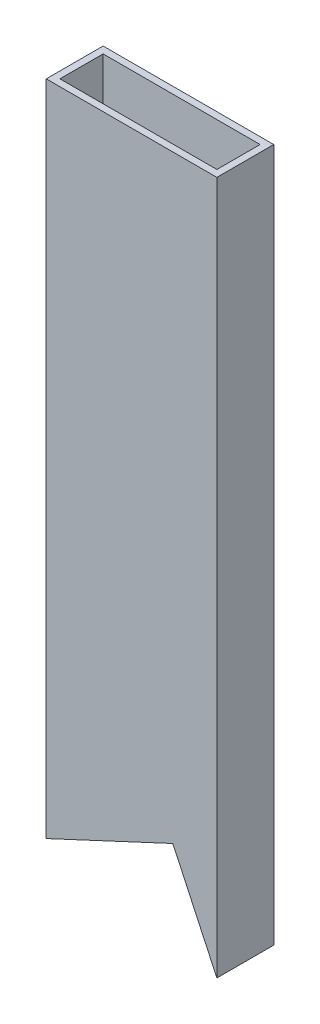
ISO-10303-21;
HEADER;
FILE_DESCRIPTION(('STEP AP214'),'2;1');
FILE_NAME('part.step','',(''),(''),'','','');
FILE_SCHEMA(('AUTOMOTIVE_DESIGN { 1 0 10303 214 1 1 1 1 }'));
ENDSEC;
DATA;
#1=APPLICATION_CONTEXT('core data for automotive mechanical design processes');
#2=APPLICATION_PROTOCOL_DEFINITION('international standard','automotive_design',2000,#1);
#3=PRODUCT_CONTEXT('',#1,'mechanical');
#4=PRODUCT('Part','Part','',(#3));
#5=PRODUCT_RELATED_PRODUCT_CATEGORY('part','',(#4));
#6=PRODUCT_DEFINITION_FORMATION('','',#4);
#7=PRODUCT_DEFINITION_CONTEXT('part definition',#1,'design');
#8=PRODUCT_DEFINITION('design','',#6,#7);
#9=PRODUCT_DEFINITION_SHAPE('','',#8);
#10=(LENGTH_UNIT() NAMED_UNIT(*) SI_UNIT(.MILLI.,.METRE.));
#11=(NAMED_UNIT(*) PLANE_ANGLE_UNIT() SI_UNIT($,.RADIAN.));
#12=(NAMED_UNIT(*) SI_UNIT($,.STERADIAN.) SOLID_ANGLE_UNIT());
#13=UNCERTAINTY_MEASURE_WITH_UNIT(LENGTH_MEASURE(1.E-05),#10,'distance_accuracy_value','');
#14=(GEOMETRIC_REPRESENTATION_CONTEXT(3) GLOBAL_UNCERTAINTY_ASSIGNED_CONTEXT((#13)) GLOBAL_UNIT_ASSIGNED_CONTEXT((#10,
#11,#12)) REPRESENTATION_CONTEXT('',''));
#15=CARTESIAN_POINT('',(0.,0.,0.));
#16=DIRECTION('',(0.,0.,1.));
#17=DIRECTION('',(1.,0.,0.));
#18=AXIS2_PLACEMENT_3D('',#15,#16,#17);
#19=CARTESIAN_POINT('',(-38.1,280.,-12.7));
#20=DIRECTION('',(1.,0.,0.));
#21=DIRECTION('',(0.,0.,-1.));
#22=AXIS2_PLACEMENT_3D('',#19,#20,#21);
#23=PLANE('',#22);
#24=DIRECTION('',(0.,0.,-1.));
#25=VECTOR('',#24,1.);
#26=CARTESIAN_POINT('',(-38.1,24.2723769367656,-12.7));
#27=LINE('',#26,#25);
#28=CARTESIAN_POINT('',(-38.1,24.2723769367656,12.7));
#29=VERTEX_POINT('',#28);
#30=CARTESIAN_POINT('',(-38.1,24.2723769367656,-12.7));
#31=VERTEX_POINT('',#30);
#32=EDGE_CURVE('E122',#29,#31,#27,.T.);
#33=ORIENTED_EDGE('',*,*,#32,.F.);
#34=DIRECTION('',(0.,-1.,0.));
#35=VECTOR('',#34,1.);
#36=CARTESIAN_POINT('',(-38.1,280.,12.7));
#37=LINE('',#36,#35);
#38=CARTESIAN_POINT('',(-38.1,318.1,12.7));
#39=VERTEX_POINT('',#38);
#40=EDGE_CURVE('E191',#39,#29,#37,.T.);
#41=ORIENTED_EDGE('',*,*,#40,.F.);
#42=DIRECTION('',(0.,0.,1.));
#43=VECTOR('',#42,1.);
#44=CARTESIAN_POINT('',(-38.1,318.1,-12.7));
#45=LINE('',#44,#43);
#46=CARTESIAN_POINT('',(-38.1,318.1,-12.7));
#47=VERTEX_POINT('',#46);
#48=EDGE_CURVE('E143',#47,#39,#45,.T.);
#49=ORIENTED_EDGE('',*,*,#48,.F.);
#50=DIRECTION('',(0.,-1.,0.));
#51=VECTOR('',#50,1.);
#52=CARTESIAN_POINT('',(-38.1,280.,-12.7));
#53=LINE('',#52,#51);
#54=EDGE_CURVE('E182',#47,#31,#53,.T.);
#55=ORIENTED_EDGE('',*,*,#54,.T.);
#56=EDGE_LOOP('',(#33,#41,#49,#55));
#57=FACE_BOUND('',#56,.T.);
#58=ADVANCED_FACE('F36',(#57),#23,.F.);
#59=CARTESIAN_POINT('',(-38.1,280.,12.7));
#60=DIRECTION('',(0.,0.,-1.));
#61=DIRECTION('',(-1.,0.,0.));
#62=AXIS2_PLACEMENT_3D('',#59,#60,#61);
#63=PLANE('',#62);
#64=DIRECTION('',(-0.906307787036651,-0.422618261740697,0.));
#65=VECTOR('',#64,1.);
#66=CARTESIAN_POINT('',(18.4285709137758,50.632082458417,12.7));
#67=LINE('',#66,#65);
#68=CARTESIAN_POINT('',(18.4285709137758,50.632082458417,12.7));
#69=VERTEX_POINT('',#68);
#70=EDGE_CURVE('E160',#69,#29,#67,.T.);
#71=ORIENTED_EDGE('',*,*,#70,.F.);
#72=DIRECTION('',(0.422618261740697,-0.906307787036651,0.));
#73=VECTOR('',#72,1.);
#74=CARTESIAN_POINT('',(18.4285709137758,50.632082458417,12.7));
#75=LINE('',#74,#73);
#76=CARTESIAN_POINT('',(38.1,8.44656664669595,12.7));
#77=VERTEX_POINT('',#76);
#78=EDGE_CURVE('E152',#69,#77,#75,.T.);
#79=ORIENTED_EDGE('',*,*,#78,.T.);
#80=DIRECTION('',(0.,-1.,0.));
#81=VECTOR('',#80,1.);
#82=CARTESIAN_POINT('',(38.1,280.,12.7));
#83=LINE('',#82,#81);
#84=CARTESIAN_POINT('',(38.1,318.1,12.7));
#85=VERTEX_POINT('',#84);
#86=EDGE_CURVE('E188',#85,#77,#83,.T.);
#87=ORIENTED_EDGE('',*,*,#86,.F.);
#88=DIRECTION('',(1.,0.,0.));
#89=VECTOR('',#88,1.);
#90=CARTESIAN_POINT('',(-38.1,318.1,12.7));
#91=LINE('',#90,#89);
#92=EDGE_CURVE('E146',#39,#85,#91,.T.);
#93=ORIENTED_EDGE('',*,*,#92,.F.);
#94=ORIENTED_EDGE('',*,*,#40,.T.);
#95=EDGE_LOOP('',(#71,#79,#87,#93,#94));
#96=FACE_BOUND('',#95,.T.);
#97=ADVANCED_FACE('F207',(#96),#63,.F.);
#98=CARTESIAN_POINT('',(-38.1,280.,-12.7));
#99=DIRECTION('',(0.,0.,1.));
#100=DIRECTION('',(1.,0.,0.));
#101=AXIS2_PLACEMENT_3D('',#98,#99,#100);
#102=PLANE('',#101);
#103=DIRECTION('',(-0.906307787036651,-0.422618261740697,0.));
#104=VECTOR('',#103,1.);
#105=CARTESIAN_POINT('',(18.4285709137758,50.632082458417,-12.7));
#106=LINE('',#105,#104);
#107=CARTESIAN_POINT('',(18.4285709137758,50.632082458417,-12.7));
#108=VERTEX_POINT('',#107);
#109=EDGE_CURVE('E162',#108,#31,#106,.T.);
#110=ORIENTED_EDGE('',*,*,#109,.T.);
#111=ORIENTED_EDGE('',*,*,#54,.F.);
#112=DIRECTION('',(-1.,0.,0.));
#113=VECTOR('',#112,1.);
#114=CARTESIAN_POINT('',(38.1,318.1,-12.7));
#115=LINE('',#114,#113);
#116=CARTESIAN_POINT('',(38.1,318.1,-12.7));
#117=VERTEX_POINT('',#116);
#118=EDGE_CURVE('E140',#117,#47,#115,.T.);
#119=ORIENTED_EDGE('',*,*,#118,.F.);
#120=DIRECTION('',(0.,-1.,0.));
#121=VECTOR('',#120,1.);
#122=CARTESIAN_POINT('',(38.1,280.,-12.7));
#123=LINE('',#122,#121);
#124=CARTESIAN_POINT('',(38.1,8.44656664669595,-12.7));
#125=VERTEX_POINT('',#124);
#126=EDGE_CURVE('E185',#117,#125,#123,.T.);
#127=ORIENTED_EDGE('',*,*,#126,.T.);
#128=DIRECTION('',(-0.422618261740697,0.906307787036651,0.));
#129=VECTOR('',#128,1.);
#130=CARTESIAN_POINT('',(18.4285709137758,50.632082458417,-12.7));
#131=LINE('',#130,#129);
#132=EDGE_CURVE('E155',#125,#108,#131,.T.);
#133=ORIENTED_EDGE('',*,*,#132,.T.);
#134=EDGE_LOOP('',(#110,#111,#119,#127,#133));
#135=FACE_BOUND('',#134,.T.);
#136=ADVANCED_FACE('F199',(#135),#102,.F.);
#137=CARTESIAN_POINT('',(-35.052,280.,-9.65199999999999));
#138=DIRECTION('',(1.,0.,0.));
#139=DIRECTION('',(0.,0.,-1.));
#140=AXIS2_PLACEMENT_3D('',#137,#138,#139);
#141=PLANE('',#140);
#142=DIRECTION('',(0.,-1.,0.));
#143=VECTOR('',#142,1.);
#144=CARTESIAN_POINT('',(-35.052,280.,9.652));
#145=LINE('',#144,#143);
#146=CARTESIAN_POINT('',(-35.052,318.1,9.652));
#147=VERTEX_POINT('',#146);
#148=CARTESIAN_POINT('',(-35.052,25.693682678822,9.652));
#149=VERTEX_POINT('',#148);
#150=EDGE_CURVE('E180',#147,#149,#145,.T.);
#151=ORIENTED_EDGE('',*,*,#150,.T.);
#152=DIRECTION('',(0.,0.,-1.));
#153=VECTOR('',#152,1.);
#154=CARTESIAN_POINT('',(-35.052,25.693682678822,-9.65199999999999));
#155=LINE('',#154,#153);
#156=CARTESIAN_POINT('',(-35.052,25.693682678822,-9.65199999999999));
#157=VERTEX_POINT('',#156);
#158=EDGE_CURVE('E119',#149,#157,#155,.T.);
#159=ORIENTED_EDGE('',*,*,#158,.T.);
#160=DIRECTION('',(0.,-1.,0.));
#161=VECTOR('',#160,1.);
#162=CARTESIAN_POINT('',(-35.052,280.,-9.65199999999999));
#163=LINE('',#162,#161);
#164=CARTESIAN_POINT('',(-35.052,318.1,-9.65199999999999));
#165=VERTEX_POINT('',#164);
#166=EDGE_CURVE('E112',#165,#157,#163,.T.);
#167=ORIENTED_EDGE('',*,*,#166,.F.);
#168=DIRECTION('',(0.,0.,1.));
#169=VECTOR('',#168,1.);
#170=CARTESIAN_POINT('',(-35.052,318.1,-9.65199999999999));
#171=LINE('',#170,#169);
#172=EDGE_CURVE('E117',#165,#147,#171,.T.);
#173=ORIENTED_EDGE('',*,*,#172,.T.);
#174=EDGE_LOOP('',(#151,#159,#167,#173));
#175=FACE_BOUND('',#174,.T.);
#176=ADVANCED_FACE('F115',(#175),#141,.T.);
#177=CARTESIAN_POINT('',(-35.052,280.,9.652));
#178=DIRECTION('',(0.,0.,-1.));
#179=DIRECTION('',(-1.,0.,0.));
#180=AXIS2_PLACEMENT_3D('',#177,#178,#179);
#181=PLANE('',#180);
#182=DIRECTION('',(0.422618261740697,-0.906307787036651,0.));
#183=VECTOR('',#182,1.);
#184=CARTESIAN_POINT('',(-78.9763997031937,259.51771603854,9.652));
#185=LINE('',#184,#183);
#186=CARTESIAN_POINT('',(18.4285709137758,50.632082458417,9.65199999999999));
#187=VERTEX_POINT('',#186);
#188=CARTESIAN_POINT('',(35.052,14.9830237404092,9.65199999999999));
#189=VERTEX_POINT('',#188);
#190=EDGE_CURVE('E166',#187,#189,#185,.T.);
#191=ORIENTED_EDGE('',*,*,#190,.F.);
#192=DIRECTION('',(-0.906307787036651,-0.422618261740697,0.));
#193=VECTOR('',#192,1.);
#194=CARTESIAN_POINT('',(62.3529706169696,71.1143664198772,9.65199999999999));
#195=LINE('',#194,#193);
#196=EDGE_CURVE('E172',#187,#149,#195,.T.);
#197=ORIENTED_EDGE('',*,*,#196,.T.);
#198=ORIENTED_EDGE('',*,*,#150,.F.);
#199=DIRECTION('',(1.,0.,0.));
#200=VECTOR('',#199,1.);
#201=CARTESIAN_POINT('',(-35.052,318.1,9.652));
#202=LINE('',#201,#200);
#203=CARTESIAN_POINT('',(35.052,318.1,9.65199999999999));
#204=VERTEX_POINT('',#203);
#205=EDGE_CURVE('E134',#147,#204,#202,.T.);
#206=ORIENTED_EDGE('',*,*,#205,.T.);
#207=DIRECTION('',(0.,-1.,0.));
#208=VECTOR('',#207,1.);
#209=CARTESIAN_POINT('',(35.052,280.,9.65199999999999));
#210=LINE('',#209,#208);
#211=EDGE_CURVE('E177',#204,#189,#210,.T.);
#212=ORIENTED_EDGE('',*,*,#211,.T.);
#213=EDGE_LOOP('',(#191,#197,#198,#206,#212));
#214=FACE_BOUND('',#213,.T.);
#215=ADVANCED_FACE('F214',(#214),#181,.T.);
#216=CARTESIAN_POINT('',(-35.052,280.,-9.65199999999999));
#217=DIRECTION('',(0.,0.,1.));
#218=DIRECTION('',(1.,0.,0.));
#219=AXIS2_PLACEMENT_3D('',#216,#217,#218);
#220=PLANE('',#219);
#221=ORIENTED_EDGE('',*,*,#166,.T.);
#222=DIRECTION('',(0.906307787036651,0.422618261740697,0.));
#223=VECTOR('',#222,1.);
#224=CARTESIAN_POINT('',(62.3529706169696,71.1143664198772,-9.652));
#225=LINE('',#224,#223);
#226=CARTESIAN_POINT('',(18.4285709137758,50.632082458417,-9.65199999999999));
#227=VERTEX_POINT('',#226);
#228=EDGE_CURVE('E11',#157,#227,#225,.T.);
#229=ORIENTED_EDGE('',*,*,#228,.T.);
#230=DIRECTION('',(-0.422618261740697,0.906307787036651,0.));
#231=VECTOR('',#230,1.);
#232=CARTESIAN_POINT('',(-78.9763997031937,259.51771603854,-9.65199999999998));
#233=LINE('',#232,#231);
#234=CARTESIAN_POINT('',(35.052,14.9830237404091,-9.652));
#235=VERTEX_POINT('',#234);
#236=EDGE_CURVE('E43',#235,#227,#233,.T.);
#237=ORIENTED_EDGE('',*,*,#236,.F.);
#238=DIRECTION('',(0.,-1.,0.));
#239=VECTOR('',#238,1.);
#240=CARTESIAN_POINT('',(35.052,280.,-9.652));
#241=LINE('',#240,#239);
#242=CARTESIAN_POINT('',(35.052,318.1,-9.652));
#243=VERTEX_POINT('',#242);
#244=EDGE_CURVE('E121',#243,#235,#241,.T.);
#245=ORIENTED_EDGE('',*,*,#244,.F.);
#246=DIRECTION('',(-1.,0.,0.));
#247=VECTOR('',#246,1.);
#248=CARTESIAN_POINT('',(35.052,318.1,-9.652));
#249=LINE('',#248,#247);
#250=EDGE_CURVE('E125',#243,#165,#249,.T.);
#251=ORIENTED_EDGE('',*,*,#250,.T.);
#252=EDGE_LOOP('',(#221,#229,#237,#245,#251));
#253=FACE_BOUND('',#252,.T.);
#254=ADVANCED_FACE('F126',(#253),#220,.T.);
#255=CARTESIAN_POINT('',(38.1,280.,-12.7));
#256=DIRECTION('',(-1.,0.,0.));
#257=DIRECTION('',(0.,0.,1.));
#258=AXIS2_PLACEMENT_3D('',#255,#256,#257);
#259=PLANE('',#258);
#260=ORIENTED_EDGE('',*,*,#86,.T.);
#261=DIRECTION('',(0.,0.,-1.));
#262=VECTOR('',#261,1.);
#263=CARTESIAN_POINT('',(38.1,8.44656664669596,-12.6999999999998));
#264=LINE('',#263,#262);
#265=EDGE_CURVE('E168',#77,#125,#264,.T.);
#266=ORIENTED_EDGE('',*,*,#265,.T.);
#267=ORIENTED_EDGE('',*,*,#126,.F.);
#268=DIRECTION('',(0.,0.,-1.));
#269=VECTOR('',#268,1.);
#270=CARTESIAN_POINT('',(38.1,318.1,12.7));
#271=LINE('',#270,#269);
#272=EDGE_CURVE('E149',#85,#117,#271,.T.);
#273=ORIENTED_EDGE('',*,*,#272,.F.);
#274=EDGE_LOOP('',(#260,#266,#267,#273));
#275=FACE_BOUND('',#274,.T.);
#276=ADVANCED_FACE('F202',(#275),#259,.F.);
#277=CARTESIAN_POINT('',(35.052,280.,-9.652));
#278=DIRECTION('',(-1.,0.,0.));
#279=DIRECTION('',(0.,0.,1.));
#280=AXIS2_PLACEMENT_3D('',#277,#278,#279);
#281=PLANE('',#280);
#282=DIRECTION('',(0.,0.,-1.));
#283=VECTOR('',#282,1.);
#284=CARTESIAN_POINT('',(35.052,14.9830237404092,-9.652));
#285=LINE('',#284,#283);
#286=EDGE_CURVE('E56',#189,#235,#285,.T.);
#287=ORIENTED_EDGE('',*,*,#286,.F.);
#288=ORIENTED_EDGE('',*,*,#211,.F.);
#289=DIRECTION('',(0.,0.,-1.));
#290=VECTOR('',#289,1.);
#291=CARTESIAN_POINT('',(35.052,318.1,9.65199999999999));
#292=LINE('',#291,#290);
#293=EDGE_CURVE('E136',#204,#243,#292,.T.);
#294=ORIENTED_EDGE('',*,*,#293,.T.);
#295=ORIENTED_EDGE('',*,*,#244,.T.);
#296=EDGE_LOOP('',(#287,#288,#294,#295));
#297=FACE_BOUND('',#296,.T.);
#298=ADVANCED_FACE('F216',(#297),#281,.T.);
#299=CARTESIAN_POINT('',(18.4285709137758,50.632082458417,12.7));
#300=DIRECTION('',(0.422618261740697,-0.906307787036651,0.));
#301=DIRECTION('',(0.906307787036651,0.422618261740697,0.));
#302=AXIS2_PLACEMENT_3D('',#299,#300,#301);
#303=PLANE('',#302);
#304=ORIENTED_EDGE('',*,*,#32,.T.);
#305=ORIENTED_EDGE('',*,*,#109,.F.);
#306=DIRECTION('',(0.,0.,1.));
#307=VECTOR('',#306,1.);
#308=CARTESIAN_POINT('',(18.4285709137758,50.632082458417,12.7));
#309=LINE('',#308,#307);
#310=EDGE_CURVE('E50',#108,#227,#309,.T.);
#311=ORIENTED_EDGE('',*,*,#310,.T.);
#312=ORIENTED_EDGE('',*,*,#228,.F.);
#313=ORIENTED_EDGE('',*,*,#158,.F.);
#314=ORIENTED_EDGE('',*,*,#196,.F.);
#315=EDGE_CURVE('E158',#187,#69,#309,.T.);
#316=ORIENTED_EDGE('',*,*,#315,.T.);
#317=ORIENTED_EDGE('',*,*,#70,.T.);
#318=EDGE_LOOP('',(#304,#305,#311,#312,#313,#314,#316,#317));
#319=FACE_BOUND('',#318,.T.);
#320=ADVANCED_FACE('F196',(#319),#303,.T.);
#321=CARTESIAN_POINT('',(34.5303266860964,16.1017557723206,0.));
#322=DIRECTION('',(0.906307787036651,0.422618261740697,0.));
#323=DIRECTION('',(-0.422618261740697,0.906307787036651,0.));
#324=AXIS2_PLACEMENT_3D('',#321,#322,#323);
#325=PLANE('',#324);
#326=ORIENTED_EDGE('',*,*,#78,.F.);
#327=ORIENTED_EDGE('',*,*,#315,.F.);
#328=ORIENTED_EDGE('',*,*,#190,.T.);
#329=ORIENTED_EDGE('',*,*,#286,.T.);
#330=ORIENTED_EDGE('',*,*,#236,.T.);
#331=ORIENTED_EDGE('',*,*,#310,.F.);
#332=ORIENTED_EDGE('',*,*,#132,.F.);
#333=ORIENTED_EDGE('',*,*,#265,.F.);
#334=EDGE_LOOP('',(#326,#327,#328,#329,#330,#331,#332,#333));
#335=FACE_BOUND('',#334,.T.);
#336=ADVANCED_FACE('F194',(#335),#325,.F.);
#337=CARTESIAN_POINT('',(0.,318.1,0.));
#338=DIRECTION('',(0.,1.,0.));
#339=DIRECTION('',(0.,0.,1.));
#340=AXIS2_PLACEMENT_3D('',#337,#338,#339);
#341=PLANE('',#340);
#342=ORIENTED_EDGE('',*,*,#118,.T.);
#343=ORIENTED_EDGE('',*,*,#48,.T.);
#344=ORIENTED_EDGE('',*,*,#92,.T.);
#345=ORIENTED_EDGE('',*,*,#272,.T.);
#346=EDGE_LOOP('',(#342,#343,#344,#345));
#347=FACE_BOUND('',#346,.T.);
#348=ORIENTED_EDGE('',*,*,#172,.F.);
#349=ORIENTED_EDGE('',*,*,#250,.F.);
#350=ORIENTED_EDGE('',*,*,#293,.F.);
#351=ORIENTED_EDGE('',*,*,#205,.F.);
#352=EDGE_LOOP('',(#348,#349,#350,#351));
#353=FACE_BOUND('',#352,.T.);
#354=ADVANCED_FACE('F132',(#347,#353),#341,.T.);
#355=CLOSED_SHELL('',(#58,#97,#136,#176,#215,#254,#276,#298,#320,#336,#354));
#356=MANIFOLD_SOLID_BREP('B2',#355);
#357=ADVANCED_BREP_SHAPE_REPRESENTATION('',(#18,#356),#14);
#358=SHAPE_DEFINITION_REPRESENTATION(#9,#357);
ENDSEC;
END-ISO-10303-21;
